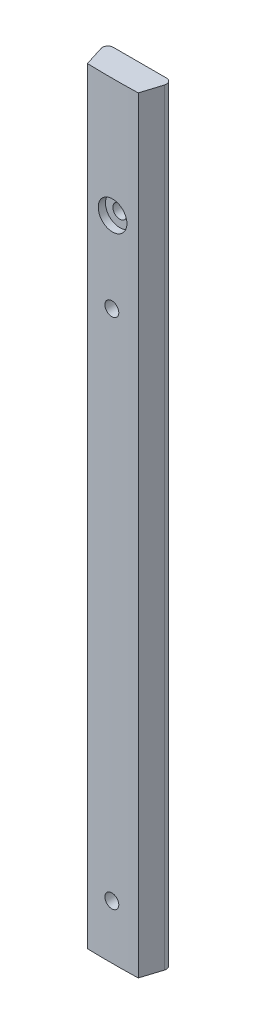
ISO-10303-21;
HEADER;
FILE_DESCRIPTION(('STEP AP214'),'2;1');
FILE_NAME('part.step','',(''),(''),'','','');
FILE_SCHEMA(('AUTOMOTIVE_DESIGN { 1 0 10303 214 1 1 1 1 }'));
ENDSEC;
DATA;
#1=APPLICATION_CONTEXT('core data for automotive mechanical design processes');
#2=APPLICATION_PROTOCOL_DEFINITION('international standard','automotive_design',2000,#1);
#3=PRODUCT_CONTEXT('',#1,'mechanical');
#4=PRODUCT('Part','Part','',(#3));
#5=PRODUCT_RELATED_PRODUCT_CATEGORY('part','',(#4));
#6=PRODUCT_DEFINITION_FORMATION('','',#4);
#7=PRODUCT_DEFINITION_CONTEXT('part definition',#1,'design');
#8=PRODUCT_DEFINITION('design','',#6,#7);
#9=PRODUCT_DEFINITION_SHAPE('','',#8);
#10=(LENGTH_UNIT() NAMED_UNIT(*) SI_UNIT(.MILLI.,.METRE.));
#11=(NAMED_UNIT(*) PLANE_ANGLE_UNIT() SI_UNIT($,.RADIAN.));
#12=(NAMED_UNIT(*) SI_UNIT($,.STERADIAN.) SOLID_ANGLE_UNIT());
#13=UNCERTAINTY_MEASURE_WITH_UNIT(LENGTH_MEASURE(1.E-05),#10,'distance_accuracy_value','');
#14=(GEOMETRIC_REPRESENTATION_CONTEXT(3) GLOBAL_UNCERTAINTY_ASSIGNED_CONTEXT((#13)) GLOBAL_UNIT_ASSIGNED_CONTEXT((#10,
#11,#12)) REPRESENTATION_CONTEXT('',''));
#15=CARTESIAN_POINT('',(0.,0.,0.));
#16=DIRECTION('',(0.,0.,1.));
#17=DIRECTION('',(1.,0.,0.));
#18=AXIS2_PLACEMENT_3D('',#15,#16,#17);
#19=CARTESIAN_POINT('',(1.9939,180.34,6.35));
#20=DIRECTION('',(0.9540716548383,0.,-0.299578499619227));
#21=DIRECTION('',(-0.299578499619227,0.,-0.9540716548383));
#22=AXIS2_PLACEMENT_3D('',#19,#20,#21);
#23=PLANE('',#22);
#24=DIRECTION('',(0.299578499619227,0.,0.9540716548383));
#25=VECTOR('',#24,1.);
#26=CARTESIAN_POINT('',(1.9939,180.34,6.35));
#27=LINE('',#26,#25);
#28=CARTESIAN_POINT('',(0.518245914078155,180.34,1.65046469451642));
#29=VERTEX_POINT('',#28);
#30=CARTESIAN_POINT('',(1.99390000000006,180.34,6.34999999999999));
#31=VERTEX_POINT('',#30);
#32=EDGE_CURVE('E97',#29,#31,#27,.T.);
#33=ORIENTED_EDGE('',*,*,#32,.F.);
#34=DIRECTION('',(0.,-1.,0.));
#35=VECTOR('',#34,1.);
#36=CARTESIAN_POINT('',(0.518245914078155,180.34,1.65046469451642));
#37=LINE('',#36,#35);
#38=CARTESIAN_POINT('',(0.518245914078155,0.,1.65046469451642));
#39=VERTEX_POINT('',#38);
#40=EDGE_CURVE('E181',#29,#39,#37,.T.);
#41=ORIENTED_EDGE('',*,*,#40,.T.);
#42=DIRECTION('',(0.299578499619227,0.,0.9540716548383));
#43=VECTOR('',#42,1.);
#44=CARTESIAN_POINT('',(1.9939,0.,6.35));
#45=LINE('',#44,#43);
#46=CARTESIAN_POINT('',(1.99390000000006,0.,6.34999999999999));
#47=VERTEX_POINT('',#46);
#48=EDGE_CURVE('E119',#39,#47,#45,.T.);
#49=ORIENTED_EDGE('',*,*,#48,.T.);
#50=DIRECTION('',(0.,-1.,0.));
#51=VECTOR('',#50,1.);
#52=CARTESIAN_POINT('',(1.99390000000006,180.34,6.34999999999999));
#53=LINE('',#52,#51);
#54=EDGE_CURVE('E113',#31,#47,#53,.T.);
#55=ORIENTED_EDGE('',*,*,#54,.F.);
#56=EDGE_LOOP('',(#33,#41,#49,#55));
#57=FACE_BOUND('',#56,.T.);
#58=ADVANCED_FACE('F37',(#57),#23,.F.);
#59=CARTESIAN_POINT('',(7.97559999999998,180.34,-196.761937771048));
#60=DIRECTION('',(0.,-1.,0.));
#61=DIRECTION('',(0.,0.,-1.));
#62=AXIS2_PLACEMENT_3D('',#59,#60,#61);
#63=CYLINDRICAL_SURFACE('',#62,203.2);
#64=CARTESIAN_POINT('',(11.34872,152.42446421903,6.41006340398023));
#65=CARTESIAN_POINT('',(11.3487116028228,152.235008593008,6.41006378238871));
#66=CARTESIAN_POINT('',(11.3327049076533,152.045415926008,6.41033124779201));
#67=CARTESIAN_POINT('',(11.2690736851983,151.671453033616,6.41137249531509));
#68=CARTESIAN_POINT('',(11.2214111895212,151.487089357163,6.41214688543111));
#69=CARTESIAN_POINT('',(11.0958264435408,151.129056284475,6.41411423404139));
#70=CARTESIAN_POINT('',(11.017918753737,150.955381788844,6.4153069911008));
#71=CARTESIAN_POINT('',(10.8340754054619,150.623625789682,6.41797641483521));
#72=CARTESIAN_POINT('',(10.7281466773547,150.465540443785,6.41945301128439));
#73=CARTESIAN_POINT('',(10.4912359873182,150.169363130823,6.42252415990603));
#74=CARTESIAN_POINT('',(10.3602492511184,150.031274982623,6.42411873452115));
#75=CARTESIAN_POINT('',(10.0769468888988,149.779043253263,6.42724591237911));
#76=CARTESIAN_POINT('',(9.924630422071,149.664900616467,6.4287785131759));
#77=CARTESIAN_POINT('',(9.60298857960761,149.463802191248,6.43160896080718));
#78=CARTESIAN_POINT('',(9.43366253963362,149.376847465242,6.43290679846705));
#79=CARTESIAN_POINT('',(9.08281308514714,149.232600617332,6.4351213201476));
#80=CARTESIAN_POINT('',(8.90128970262067,149.175308417645,6.43603800516775));
#81=CARTESIAN_POINT('',(8.53121581038614,149.092017775138,6.437386805459));
#82=CARTESIAN_POINT('',(8.34266594537907,149.066016468537,6.43781896507422));
#83=CARTESIAN_POINT('',(7.96387707165026,149.046036916663,6.43815014257954));
#84=CARTESIAN_POINT('',(7.77363806710518,149.05205859223,6.43804916178756));
#85=CARTESIAN_POINT('',(7.39689058699582,149.095951521628,6.43732548273815));
#86=CARTESIAN_POINT('',(7.21038174680259,149.133819646689,6.43670283573209));
#87=CARTESIAN_POINT('',(6.8463689108128,149.240325719582,6.43500607369341));
#88=CARTESIAN_POINT('',(6.66886492768258,149.308963710694,6.43393195802578));
#89=CARTESIAN_POINT('',(6.32789067062203,149.475064693979,6.43145325646011));
#90=CARTESIAN_POINT('',(6.16442109557823,149.572529120581,6.43004865411747));
#91=CARTESIAN_POINT('',(5.85616374442691,149.793515167544,6.42706731850161));
#92=CARTESIAN_POINT('',(5.71137597614947,149.917036798826,6.42549058515623));
#93=CARTESIAN_POINT('',(5.4445739558917,150.186648660855,6.422342505124));
#94=CARTESIAN_POINT('',(5.32256245622761,150.332741615258,6.42077115911064));
#95=CARTESIAN_POINT('',(5.10479766838019,150.643339398926,6.41781120191701));
#96=CARTESIAN_POINT('',(5.00904438385582,150.807844230756,6.41642259076221));
#97=CARTESIAN_POINT('',(4.84651449884216,151.150597482433,6.4139846787907));
#98=CARTESIAN_POINT('',(4.77973798113523,151.328845941541,6.41293537894337));
#99=CARTESIAN_POINT('',(4.67705894666246,151.694025850802,6.41129443788443));
#100=CARTESIAN_POINT('',(4.64115640319315,151.880957293445,6.41070279627699));
#101=CARTESIAN_POINT('',(4.60124783764892,152.258172863403,6.41004394603724));
#102=CARTESIAN_POINT('',(4.5972380081531,152.448456587798,6.40997667480448));
#103=CARTESIAN_POINT('',(4.62121878080885,152.826996165889,6.41037398658509));
#104=CARTESIAN_POINT('',(4.6492093726176,153.015252020241,6.41083856942657));
#105=CARTESIAN_POINT('',(4.73639327436533,153.384381269091,6.4122471560628));
#106=CARTESIAN_POINT('',(4.79558485978915,153.565255071008,6.41319113336076));
#107=CARTESIAN_POINT('',(4.94348872931027,153.914498255294,6.4154520635092));
#108=CARTESIAN_POINT('',(5.03220102895935,154.082867631075,6.41676901655616));
#109=CARTESIAN_POINT('',(5.23663788565666,154.402340036258,6.41962757986307));
#110=CARTESIAN_POINT('',(5.35236500723527,154.55344142437,6.42116921144664));
#111=CARTESIAN_POINT('',(5.60754264534073,154.834072128035,6.42430325480883));
#112=CARTESIAN_POINT('',(5.7469931870476,154.96360142069,6.42589566664135));
#113=CARTESIAN_POINT('',(6.04567540401381,155.197423652298,6.42895192586913));
#114=CARTESIAN_POINT('',(6.20490900446969,155.301714132209,6.43041576072817));
#115=CARTESIAN_POINT('',(6.53862722169922,155.482081385378,6.43304965789855));
#116=CARTESIAN_POINT('',(6.7131118167657,155.558158198792,6.43421972062802));
#117=CARTESIAN_POINT('',(7.07236971588751,155.679934320578,6.43613410516865));
#118=CARTESIAN_POINT('',(7.25714247582176,155.725635233821,6.43687844947182));
#119=CARTESIAN_POINT('',(7.63173956986867,155.785367558489,6.43785757171699));
#120=CARTESIAN_POINT('',(7.82156390894399,155.799398938802,6.43809234915836));
#121=CARTESIAN_POINT('',(8.20085060928758,155.795393612218,6.43802586919465));
#122=CARTESIAN_POINT('',(8.39031301188439,155.77736081667,6.43772467716975));
#123=CARTESIAN_POINT('',(8.76352109145255,155.709746991602,6.43662033689687));
#124=CARTESIAN_POINT('',(8.94726675697265,155.660165898892,6.43581718764349));
#125=CARTESIAN_POINT('',(9.30382896127938,155.53086265055,6.43379944217819));
#126=CARTESIAN_POINT('',(9.47664530009368,155.451139943608,6.43258483844054));
#127=CARTESIAN_POINT('',(9.80643493525647,155.263820222545,6.42988113959192));
#128=CARTESIAN_POINT('',(9.96340883829934,155.156224276408,6.42839205499851));
#129=CARTESIAN_POINT('',(10.2570700478114,154.916209874321,6.42530715057074));
#130=CARTESIAN_POINT('',(10.3937570383994,154.783791031934,6.42371132907499));
#131=CARTESIAN_POINT('',(10.6429953494318,154.497846628208,6.42059244032234));
#132=CARTESIAN_POINT('',(10.7555406695137,154.344315835061,6.41906939122582));
#133=CARTESIAN_POINT('',(10.9533072093302,154.020468838419,6.41626745264257));
#134=CARTESIAN_POINT('',(11.0385139283425,153.850143789454,6.41498869287484));
#135=CARTESIAN_POINT('',(11.1790240680285,153.497736908632,6.41282212586695));
#136=CARTESIAN_POINT('',(11.234363279274,153.31566944219,6.41193385094235));
#137=CARTESIAN_POINT('',(11.2988440082216,153.014448003036,6.41088673750306));
#138=CARTESIAN_POINT('',(11.3175241042297,152.897250671489,6.41057932095988));
#139=CARTESIAN_POINT('',(11.3424647271365,152.661541523736,6.41016753579932));
#140=CARTESIAN_POINT('',(11.3487252551378,152.543029707646,6.4100631671639));
#141=CARTESIAN_POINT('',(11.34872,152.42446421903,6.41006340398023));
#142=B_SPLINE_CURVE_WITH_KNOTS('',3,(#64,#65,#66,#67,#68,#69,#70,#71,#72,#73,#74,#75,#76,#77,
#78,#79,#80,#81,#82,#83,#84,#85,#86,#87,#88,#89,#90,#91,#92,#93,#94,#95,#96,#97,#98,#99,#100,
#101,#102,#103,#104,#105,#106,#107,#108,#109,#110,#111,#112,#113,#114,#115,#116,#117,#118,#119,
#120,#121,#122,#123,#124,#125,#126,#127,#128,#129,#130,#131,#132,#133,#134,#135,#136,#137,#138,
#139,#140,#141),.UNSPECIFIED.,.T.,.F.,(4,2,2,2,2,2,2,2,2,2,2,2,2,2,2,2,2,2,2,2,2,2,2,2,2,2,2,2,
2,2,2,2,2,2,2,2,2,2,4),(0.,0.567934109544087,1.13655064000253,1.70489376853619,2.27309646158712,
2.84140752159343,3.40974099046795,3.97809666523032,4.54645084960929,5.11475301355387,
5.68305377267444,6.25129870534321,6.8195444372903,7.38781845038863,7.95609270166594,
8.52443557960974,9.09277853674933,9.66112311755025,10.2294672067789,10.7977434448474,
11.3660194992437,11.934264147655,12.5025090954231,13.0708080089176,13.6391075256074,
14.2074623899828,14.7758164454163,15.3441404702053,15.9124650533352,16.4807203141805,
17.0489767132285,17.6172435065762,18.1854885295852,18.7537423996301,19.3221373447686,
19.8908332769195,20.458846212673,20.8142718740284,21.1696975038351),.UNSPECIFIED.);
#143=CARTESIAN_POINT('',(11.34872,152.42446421903,6.41006340398023));
#144=VERTEX_POINT('',#143);
#145=EDGE_CURVE('E11',#144,#144,#142,.T.);
#146=ORIENTED_EDGE('',*,*,#145,.T.);
#147=EDGE_LOOP('',(#146));
#148=FACE_BOUND('',#147,.T.);
#149=CARTESIAN_POINT('',(7.97559999999998,131.724817875999,6.43806222895219));
#150=CARTESIAN_POINT('',(7.88431424822669,131.716482364532,6.43806213856655));
#151=CARTESIAN_POINT('',(7.79225808516119,131.715849679626,6.43800005020058));
#152=CARTESIAN_POINT('',(7.60926987110244,131.730049592546,6.4377526810281));
#153=CARTESIAN_POINT('',(7.51833930653425,131.744900806295,6.43756725202921));
#154=CARTESIAN_POINT('',(7.34029856002619,131.789655422659,6.43708858607937));
#155=CARTESIAN_POINT('',(7.25318657257777,131.819551626362,6.4367954007071));
#156=CARTESIAN_POINT('',(7.08524255894046,131.893536649359,6.43612895862586));
#157=CARTESIAN_POINT('',(7.0044089798008,131.937621945046,6.43575572180391));
#158=CARTESIAN_POINT('',(6.85127880177196,132.038741898058,6.43496617625431));
#159=CARTESIAN_POINT('',(6.77898327004224,132.095778171512,6.43454986215467));
#160=CARTESIAN_POINT('',(6.64499109506514,132.221180707891,6.43371665880684));
#161=CARTESIAN_POINT('',(6.5832948690467,132.289547416616,6.43329976953665));
#162=CARTESIAN_POINT('',(6.47225574509907,132.43566876454,6.43250863055911));
#163=CARTESIAN_POINT('',(6.42291287233058,132.513423422858,6.43213438093861));
#164=CARTESIAN_POINT('',(6.33798155361438,132.676113289372,6.43146767728867));
#165=CARTESIAN_POINT('',(6.30239307837522,132.761048482276,6.43117522308503));
#166=CARTESIAN_POINT('',(6.24598130487599,132.935686981974,6.43070289483852));
#167=CARTESIAN_POINT('',(6.22515775361461,133.025390207039,6.43052301886658));
#168=CARTESIAN_POINT('',(6.19886613773452,133.207019421458,6.43029483768381));
#169=CARTESIAN_POINT('',(6.19339804205127,133.298945406316,6.4302465322068));
#170=CARTESIAN_POINT('',(6.19797244345632,133.482407654437,6.43028660032644));
#171=CARTESIAN_POINT('',(6.20801444367391,133.573943930092,6.43037496954468));
#172=CARTESIAN_POINT('',(6.2433230016243,133.75403137867,6.43067903436351));
#173=CARTESIAN_POINT('',(6.26858957557231,133.842582548415,6.43089473009973));
#174=CARTESIAN_POINT('',(6.3336299858266,134.01418621545,6.43143068696838));
#175=CARTESIAN_POINT('',(6.37340384370074,134.097238704566,6.43175094825628));
#176=CARTESIAN_POINT('',(6.4663296918883,134.255487501418,6.43246238092685));
#177=CARTESIAN_POINT('',(6.5194816797676,134.330683810584,6.43285355229662));
#178=CARTESIAN_POINT('',(6.63765706614934,134.471088376568,6.43366599597863));
#179=CARTESIAN_POINT('',(6.70268086206281,134.536296298888,6.43408726929825));
#180=CARTESIAN_POINT('',(6.84275300904769,134.654870193758,6.43491641920782));
#181=CARTESIAN_POINT('',(6.91780136248668,134.70823616351,6.43532429579461));
#182=CARTESIAN_POINT('',(7.07579369241682,134.801612035962,6.43608530070316));
#183=CARTESIAN_POINT('',(7.15873779472453,134.841621725788,6.43643842815228));
#184=CARTESIAN_POINT('',(7.33016613017262,134.907147973031,6.43705522668769));
#185=CARTESIAN_POINT('',(7.41865036220599,134.932664533343,6.43731889779184));
#186=CARTESIAN_POINT('',(7.59864500225191,134.968479601402,6.43773250521641));
#187=CARTESIAN_POINT('',(7.69015534051967,134.978778459632,6.43788244415619));
#188=CARTESIAN_POINT('',(7.87360631236106,134.983866770805,6.43805733300644));
#189=CARTESIAN_POINT('',(7.96554694588195,134.978656225649,6.43808228293223));
#190=CARTESIAN_POINT('',(8.14724610260202,134.952873970405,6.43801004860094));
#191=CARTESIAN_POINT('',(8.23700468152284,134.932302653002,6.43791286746599));
#192=CARTESIAN_POINT('',(8.41179422673059,134.876383328365,6.43761286431377));
#193=CARTESIAN_POINT('',(8.4968251933199,134.841035322077,6.43741004230325));
#194=CARTESIAN_POINT('',(8.6597466393987,134.756565708795,6.4369268609132));
#195=CARTESIAN_POINT('',(8.73763705461159,134.707443977832,6.43664650083579));
#196=CARTESIAN_POINT('',(8.88406571782481,134.596821412233,6.43604465084853));
#197=CARTESIAN_POINT('',(8.95260396039356,134.535320570407,6.43572316091479));
#198=CARTESIAN_POINT('',(9.07838454379061,134.401683677518,6.43507950990417));
#199=CARTESIAN_POINT('',(9.13562658287217,134.329547342445,6.43475734880959));
#200=CARTESIAN_POINT('',(9.23718753441021,134.176688378562,6.43415221369749));
#201=CARTESIAN_POINT('',(9.28150646046484,134.095965758786,6.43386923963873));
#202=CARTESIAN_POINT('',(9.355963184878,133.928225431026,6.43337711365413));
#203=CARTESIAN_POINT('',(9.38610096541735,133.841207715132,6.43316796182105));
#204=CARTESIAN_POINT('',(9.43133971337324,133.66334732634,6.43284892007526));
#205=CARTESIAN_POINT('',(9.446440656141,133.572504647172,6.43273903032525));
#206=CARTESIAN_POINT('',(9.46117669879655,133.389575692135,6.43263183602347));
#207=CARTESIAN_POINT('',(9.46081219030212,133.297489447815,6.43263452862087));
#208=CARTESIAN_POINT('',(9.4446286211387,133.114685032301,6.43275216592183));
#209=CARTESIAN_POINT('',(9.42880953030005,133.023966863778,6.43286711084453));
#210=CARTESIAN_POINT('',(9.38216571242669,132.846473166401,6.43319531989032));
#211=CARTESIAN_POINT('',(9.35134083894985,132.759697676033,6.43340858497293));
#212=CARTESIAN_POINT('',(9.27556176624201,132.592556757529,6.4339074797193));
#213=CARTESIAN_POINT('',(9.23060811930015,132.512191078988,6.43419310655437));
#214=CARTESIAN_POINT('',(9.12785234444079,132.360153613818,6.43480173303033));
#215=CARTESIAN_POINT('',(9.0700512981975,132.28848109606,6.43512472952382));
#216=CARTESIAN_POINT('',(8.943219902479,132.155838814001,6.43576822615359));
#217=CARTESIAN_POINT('',(8.87418676601513,132.094871713832,6.43608872564956));
#218=CARTESIAN_POINT('',(8.72683663253741,131.985368429439,6.43668690294309));
#219=CARTESIAN_POINT('',(8.64851507586061,131.936838387794,6.436964559554));
#220=CARTESIAN_POINT('',(8.48489589391178,131.853669356951,6.43744037859891));
#221=CARTESIAN_POINT('',(8.39960677017553,131.819013734783,6.43763863621833));
#222=CARTESIAN_POINT('',(8.25736744198429,131.774739108791,6.43787427988784));
#223=CARTESIAN_POINT('',(8.20178018154065,131.760604719937,6.43794411151631));
#224=CARTESIAN_POINT('',(8.08942896818944,131.738249472323,6.43803811429938));
#225=CARTESIAN_POINT('',(8.03266501529589,131.730028613492,6.43806228545452));
#226=CARTESIAN_POINT('',(7.97559999999998,131.724817875999,6.43806222895219));
#227=B_SPLINE_CURVE_WITH_KNOTS('',3,(#149,#150,#151,#152,#153,#154,#155,#156,#157,#158,#159,
#160,#161,#162,#163,#164,#165,#166,#167,#168,#169,#170,#171,#172,#173,#174,#175,#176,#177,#178,
#179,#180,#181,#182,#183,#184,#185,#186,#187,#188,#189,#190,#191,#192,#193,#194,#195,#196,#197,
#198,#199,#200,#201,#202,#203,#204,#205,#206,#207,#208,#209,#210,#211,#212,#213,#214,#215,#216,
#217,#218,#219,#220,#221,#222,#223,#224,#225,#226),.UNSPECIFIED.,.T.,.F.,(4,2,2,2,2,2,2,2,2,2,2,
2,2,2,2,2,2,2,2,2,2,2,2,2,2,2,2,2,2,2,2,2,2,2,2,2,2,2,4),(0.,0.274787433795373,
0.549905619375806,0.824892288012678,1.09981072123875,1.37476347987757,1.6497270592225,
1.92469119859528,2.19965475239981,2.47461359450935,2.74957188036875,3.02452135803742,
3.29947112854664,3.57442130782287,3.84937143707221,4.12433077201746,4.39929017190188,
4.67425395392105,4.94921768099808,5.22417507520374,5.49913243569715,5.77408276740186,
6.04903308152043,6.32398587039712,6.59893881896119,6.87389911113674,7.14885911398853,
7.42381946233776,7.69878026140848,7.97373409789694,8.24868847113767,8.52364552772473,
8.79859183766677,9.07351500753652,9.34850649768334,9.62363354365946,9.89842976626594,
10.0702062921185,10.2419828159247),.UNSPECIFIED.);
#228=CARTESIAN_POINT('',(7.97559999999998,131.724817875999,6.43806222895219));
#229=VERTEX_POINT('',#228);
#230=EDGE_CURVE('E124',#229,#229,#227,.T.);
#231=ORIENTED_EDGE('',*,*,#230,.T.);
#232=EDGE_LOOP('',(#231));
#233=FACE_BOUND('',#232,.T.);
#234=CARTESIAN_POINT('',(7.97559999999998,11.0748178759992,6.43806222895219));
#235=CARTESIAN_POINT('',(7.88431424822669,11.0664823645321,6.43806213856655));
#236=CARTESIAN_POINT('',(7.79225808516119,11.0658496796257,6.43800005020058));
#237=CARTESIAN_POINT('',(7.60926987110244,11.0800495925458,6.4377526810281));
#238=CARTESIAN_POINT('',(7.51833930653425,11.0949008062954,6.43756725202921));
#239=CARTESIAN_POINT('',(7.34029856002619,11.1396554226593,6.43708858607937));
#240=CARTESIAN_POINT('',(7.25318657257778,11.1695516263617,6.4367954007071));
#241=CARTESIAN_POINT('',(7.08524255894046,11.2435366493587,6.43612895862586));
#242=CARTESIAN_POINT('',(7.0044089798008,11.2876219450455,6.43575572180391));
#243=CARTESIAN_POINT('',(6.85127880177196,11.3887418980584,6.43496617625432));
#244=CARTESIAN_POINT('',(6.77898327004223,11.4457781715121,6.43454986215468));
#245=CARTESIAN_POINT('',(6.64499109506514,11.5711807078906,6.43371665880684));
#246=CARTESIAN_POINT('',(6.5832948690467,11.6395474166165,6.43329976953665));
#247=CARTESIAN_POINT('',(6.47225574509907,11.7856687645397,6.43250863055911));
#248=CARTESIAN_POINT('',(6.42291287233059,11.8634234228575,6.43213438093861));
#249=CARTESIAN_POINT('',(6.33798155361438,12.0261132893716,6.43146767728867));
#250=CARTESIAN_POINT('',(6.30239307837523,12.1110484822756,6.43117522308504));
#251=CARTESIAN_POINT('',(6.245981304876,12.2856869819744,6.43070289483852));
#252=CARTESIAN_POINT('',(6.22515775361462,12.3753902070392,6.43052301886658));
#253=CARTESIAN_POINT('',(6.19886613773452,12.5570194214583,6.43029483768381));
#254=CARTESIAN_POINT('',(6.19339804205127,12.6489454063157,6.4302465322068));
#255=CARTESIAN_POINT('',(6.19797244345632,12.8324076544373,6.43028660032644));
#256=CARTESIAN_POINT('',(6.20801444367391,12.9239439300918,6.43037496954467));
#257=CARTESIAN_POINT('',(6.2433230016243,13.1040313786702,6.43067903436351));
#258=CARTESIAN_POINT('',(6.26858957557231,13.1925825484145,6.43089473009973));
#259=CARTESIAN_POINT('',(6.3336299858266,13.3641862154501,6.43143068696839));
#260=CARTESIAN_POINT('',(6.37340384370073,13.4472387045662,6.43175094825629));
#261=CARTESIAN_POINT('',(6.4663296918883,13.6054875014184,6.43246238092685));
#262=CARTESIAN_POINT('',(6.51948167976759,13.6806838105839,6.43285355229662));
#263=CARTESIAN_POINT('',(6.63765706614933,13.8210883765676,6.43366599597863));
#264=CARTESIAN_POINT('',(6.7026808620628,13.8862962988882,6.43408726929825));
#265=CARTESIAN_POINT('',(6.84275300904769,14.0048701937576,6.43491641920782));
#266=CARTESIAN_POINT('',(6.91780136248668,14.0582361635096,6.43532429579461));
#267=CARTESIAN_POINT('',(7.07579369241683,14.1516120359622,6.43608530070316));
#268=CARTESIAN_POINT('',(7.15873779472453,14.1916217257884,6.43643842815228));
#269=CARTESIAN_POINT('',(7.33016613017262,14.2571479730308,6.43705522668769));
#270=CARTESIAN_POINT('',(7.41865036220599,14.2826645333428,6.43731889779185));
#271=CARTESIAN_POINT('',(7.59864500225191,14.3184796014016,6.43773250521641));
#272=CARTESIAN_POINT('',(7.69015534051966,14.328778459632,6.43788244415617));
#273=CARTESIAN_POINT('',(7.87360631236106,14.3338667708046,6.43805733300641));
#274=CARTESIAN_POINT('',(7.96554694588194,14.3286562256485,6.43808228293222));
#275=CARTESIAN_POINT('',(8.14724610260202,14.3028739704052,6.43801004860095));
#276=CARTESIAN_POINT('',(8.23700468152284,14.282302653002,6.437912867466));
#277=CARTESIAN_POINT('',(8.41179422673058,14.2263833283651,6.43761286431377));
#278=CARTESIAN_POINT('',(8.49682519331989,14.1910353220765,6.43741004230325));
#279=CARTESIAN_POINT('',(8.6597466393987,14.1065657087947,6.4369268609132));
#280=CARTESIAN_POINT('',(8.7376370546116,14.0574439778315,6.43664650083579));
#281=CARTESIAN_POINT('',(8.88406571782483,13.9468214122327,6.43604465084853));
#282=CARTESIAN_POINT('',(8.95260396039357,13.8853205704074,6.43572316091479));
#283=CARTESIAN_POINT('',(9.07838454379062,13.7516836775177,6.43507950990417));
#284=CARTESIAN_POINT('',(9.13562658287218,13.6795473424453,6.43475734880959));
#285=CARTESIAN_POINT('',(9.23718753441022,13.526688378562,6.43415221369749));
#286=CARTESIAN_POINT('',(9.28150646046484,13.4459657587858,6.43386923963873));
#287=CARTESIAN_POINT('',(9.355963184878,13.2782254310255,6.43337711365413));
#288=CARTESIAN_POINT('',(9.38610096541735,13.1912077151315,6.43316796182105));
#289=CARTESIAN_POINT('',(9.43133971337324,13.0133473263395,6.43284892007526));
#290=CARTESIAN_POINT('',(9.446440656141,12.9225046471718,6.43273903032525));
#291=CARTESIAN_POINT('',(9.46117669879655,12.7395756921352,6.43263183602347));
#292=CARTESIAN_POINT('',(9.46081219030212,12.6474894478151,6.43263452862087));
#293=CARTESIAN_POINT('',(9.4446286211387,12.4646850323008,6.43275216592183));
#294=CARTESIAN_POINT('',(9.42880953030005,12.3739668637777,6.43286711084453));
#295=CARTESIAN_POINT('',(9.3821657124267,12.1964731664009,6.43319531989032));
#296=CARTESIAN_POINT('',(9.35134083894986,12.1096976760331,6.43340858497293));
#297=CARTESIAN_POINT('',(9.27556176624201,11.9425567575285,6.4339074797193));
#298=CARTESIAN_POINT('',(9.23060811930014,11.8621910789882,6.43419310655437));
#299=CARTESIAN_POINT('',(9.12785234444079,11.7101536138177,6.43480173303033));
#300=CARTESIAN_POINT('',(9.07005129819749,11.6384810960602,6.43512472952382));
#301=CARTESIAN_POINT('',(8.943219902479,11.5058388140007,6.43576822615359));
#302=CARTESIAN_POINT('',(8.87418676601514,11.4448717138319,6.43608872564956));
#303=CARTESIAN_POINT('',(8.72683663253743,11.3353684294389,6.43668690294309));
#304=CARTESIAN_POINT('',(8.64851507586062,11.2868383877938,6.436964559554));
#305=CARTESIAN_POINT('',(8.48489589391178,11.2036693569508,6.43744037859891));
#306=CARTESIAN_POINT('',(8.39960677017553,11.1690137347831,6.43763863621833));
#307=CARTESIAN_POINT('',(8.25736744198429,11.1247391087907,6.43787427988784));
#308=CARTESIAN_POINT('',(8.20178018154064,11.1106047199373,6.43794411151631));
#309=CARTESIAN_POINT('',(8.08942896818943,11.0882494723234,6.43803811429938));
#310=CARTESIAN_POINT('',(8.03266501529589,11.0800286134925,6.43806228545452));
#311=CARTESIAN_POINT('',(7.97559999999998,11.0748178759992,6.43806222895219));
#312=B_SPLINE_CURVE_WITH_KNOTS('',3,(#234,#235,#236,#237,#238,#239,#240,#241,#242,#243,#244,
#245,#246,#247,#248,#249,#250,#251,#252,#253,#254,#255,#256,#257,#258,#259,#260,#261,#262,#263,
#264,#265,#266,#267,#268,#269,#270,#271,#272,#273,#274,#275,#276,#277,#278,#279,#280,#281,#282,
#283,#284,#285,#286,#287,#288,#289,#290,#291,#292,#293,#294,#295,#296,#297,#298,#299,#300,#301,
#302,#303,#304,#305,#306,#307,#308,#309,#310,#311),.UNSPECIFIED.,.T.,.F.,(4,2,2,2,2,2,2,2,2,2,2,
2,2,2,2,2,2,2,2,2,2,2,2,2,2,2,2,2,2,2,2,2,2,2,2,2,2,2,4),(0.,0.274787433795373,
0.549905619375801,0.824892288012675,1.09981072123875,1.37476347987758,1.6497270592225,
1.92469119859527,2.19965475239979,2.47461359450933,2.74957188036875,3.02452135803741,
3.29947112854663,3.57442130782285,3.84937143707219,4.12433077201746,4.3992901719019,
4.67425395392106,4.94921768099808,5.22417507520374,5.49913243569715,5.77408276740187,
6.04903308152043,6.32398587039714,6.59893881896121,6.87389911113677,7.14885911398854,
7.42381946233776,7.69878026140846,7.97373409789692,8.24868847113765,8.52364552772474,
8.7985918376668,9.07351500753653,9.34850649768333,9.62363354365947,9.89842976626595,
10.0702062921185,10.2419828159247),.UNSPECIFIED.);
#313=CARTESIAN_POINT('',(7.97559999999998,11.0748178759992,6.43806222895219));
#314=VERTEX_POINT('',#313);
#315=EDGE_CURVE('E121',#314,#314,#312,.T.);
#316=ORIENTED_EDGE('',*,*,#315,.T.);
#317=EDGE_LOOP('',(#316));
#318=FACE_BOUND('',#317,.T.);
#319=CARTESIAN_POINT('',(7.97559999999998,0.,-196.761937771048));
#320=DIRECTION('',(0.,1.,0.));
#321=DIRECTION('',(0.,0.,-1.));
#322=AXIS2_PLACEMENT_3D('',#319,#320,#321);
#323=CIRCLE('',#322,203.2);
#324=CARTESIAN_POINT('',(13.9573,0.,6.35));
#325=VERTEX_POINT('',#324);
#326=EDGE_CURVE('E258',#47,#325,#323,.T.);
#327=ORIENTED_EDGE('',*,*,#326,.T.);
#328=DIRECTION('',(0.,-1.,0.));
#329=VECTOR('',#328,1.);
#330=CARTESIAN_POINT('',(13.9573,180.34,6.35));
#331=LINE('',#330,#329);
#332=CARTESIAN_POINT('',(13.9573,180.34,6.35));
#333=VERTEX_POINT('',#332);
#334=EDGE_CURVE('E115',#333,#325,#331,.T.);
#335=ORIENTED_EDGE('',*,*,#334,.F.);
#336=CARTESIAN_POINT('',(7.97559999999998,180.34,-196.761937771048));
#337=DIRECTION('',(0.,1.,0.));
#338=DIRECTION('',(0.,0.,-1.));
#339=AXIS2_PLACEMENT_3D('',#336,#337,#338);
#340=CIRCLE('',#339,203.2);
#341=EDGE_CURVE('E100',#31,#333,#340,.T.);
#342=ORIENTED_EDGE('',*,*,#341,.F.);
#343=ORIENTED_EDGE('',*,*,#54,.T.);
#344=EDGE_LOOP('',(#327,#335,#342,#343));
#345=FACE_BOUND('',#344,.T.);
#346=ADVANCED_FACE('F112',(#148,#233,#318,#345),#63,.T.);
#347=CARTESIAN_POINT('',(15.9512,180.34,0.));
#348=DIRECTION('',(-0.9540716548383,0.,-0.299578499619226));
#349=DIRECTION('',(-0.299578499619226,0.,0.9540716548383));
#350=AXIS2_PLACEMENT_3D('',#347,#348,#349);
#351=PLANE('',#350);
#352=DIRECTION('',(0.299578499619226,0.,-0.954071654838301));
#353=VECTOR('',#352,1.);
#354=CARTESIAN_POINT('',(15.9512,0.,0.));
#355=LINE('',#354,#353);
#356=CARTESIAN_POINT('',(15.4329540859218,0.,1.65046469451642));
#357=VERTEX_POINT('',#356);
#358=EDGE_CURVE('E260',#325,#357,#355,.T.);
#359=ORIENTED_EDGE('',*,*,#358,.T.);
#360=DIRECTION('',(0.,-1.,0.));
#361=VECTOR('',#360,1.);
#362=CARTESIAN_POINT('',(15.4329540859218,180.34,1.65046469451642));
#363=LINE('',#362,#361);
#364=CARTESIAN_POINT('',(15.4329540859218,180.34,1.65046469451642));
#365=VERTEX_POINT('',#364);
#366=EDGE_CURVE('E50',#357,#365,#363,.F.);
#367=ORIENTED_EDGE('',*,*,#366,.T.);
#368=DIRECTION('',(0.299578499619226,0.,-0.954071654838301));
#369=VECTOR('',#368,1.);
#370=CARTESIAN_POINT('',(15.9512,180.34,0.));
#371=LINE('',#370,#369);
#372=EDGE_CURVE('E116',#333,#365,#371,.T.);
#373=ORIENTED_EDGE('',*,*,#372,.F.);
#374=ORIENTED_EDGE('',*,*,#334,.T.);
#375=EDGE_LOOP('',(#359,#367,#373,#374));
#376=FACE_BOUND('',#375,.T.);
#377=ADVANCED_FACE('F158',(#376),#351,.F.);
#378=CARTESIAN_POINT('',(0.,180.34,0.));
#379=DIRECTION('',(0.,0.,1.));
#380=DIRECTION('',(1.,0.,0.));
#381=AXIS2_PLACEMENT_3D('',#378,#379,#380);
#382=PLANE('',#381);
#383=CARTESIAN_POINT('',(7.97560000000003,152.42446421903,0.));
#384=DIRECTION('',(0.,0.,1.));
#385=DIRECTION('',(1.,0.,0.));
#386=AXIS2_PLACEMENT_3D('',#383,#384,#385);
#387=CIRCLE('',#386,1.63195);
#388=CARTESIAN_POINT('',(9.60755000000003,152.42446421903,0.));
#389=VERTEX_POINT('',#388);
#390=EDGE_CURVE('E233',#389,#389,#387,.T.);
#391=ORIENTED_EDGE('',*,*,#390,.T.);
#392=EDGE_LOOP('',(#391));
#393=FACE_BOUND('',#392,.T.);
#394=CARTESIAN_POINT('',(7.82712823053444,133.35,0.));
#395=DIRECTION('',(0.,0.,-1.));
#396=DIRECTION('',(-1.,0.,0.));
#397=AXIS2_PLACEMENT_3D('',#394,#395,#396);
#398=CIRCLE('',#397,3.37312);
#399=CARTESIAN_POINT('',(4.45400823053444,133.35,0.));
#400=VERTEX_POINT('',#399);
#401=EDGE_CURVE('E238',#400,#400,#398,.T.);
#402=ORIENTED_EDGE('',*,*,#401,.F.);
#403=EDGE_LOOP('',(#402));
#404=FACE_BOUND('',#403,.T.);
#405=CARTESIAN_POINT('',(7.82712823053444,12.7,0.));
#406=DIRECTION('',(0.,0.,-1.));
#407=DIRECTION('',(-1.,0.,0.));
#408=AXIS2_PLACEMENT_3D('',#405,#406,#407);
#409=CIRCLE('',#408,3.37312);
#410=CARTESIAN_POINT('',(4.45400823053444,12.7,0.));
#411=VERTEX_POINT('',#410);
#412=EDGE_CURVE('E246',#411,#411,#409,.T.);
#413=ORIENTED_EDGE('',*,*,#412,.F.);
#414=EDGE_LOOP('',(#413));
#415=FACE_BOUND('',#414,.T.);
#416=DIRECTION('',(-1.,0.,0.));
#417=VECTOR('',#416,1.);
#418=CARTESIAN_POINT('',(0.,0.,0.));
#419=LINE('',#418,#417);
#420=CARTESIAN_POINT('',(14.2212830842772,0.,0.));
#421=VERTEX_POINT('',#420);
#422=CARTESIAN_POINT('',(1.7299169157228,0.,0.));
#423=VERTEX_POINT('',#422);
#424=EDGE_CURVE('E108',#421,#423,#419,.T.);
#425=ORIENTED_EDGE('',*,*,#424,.T.);
#426=DIRECTION('',(0.,-1.,0.));
#427=VECTOR('',#426,1.);
#428=CARTESIAN_POINT('',(1.7299169157228,180.34,0.));
#429=LINE('',#428,#427);
#430=CARTESIAN_POINT('',(1.7299169157228,180.34,0.));
#431=VERTEX_POINT('',#430);
#432=EDGE_CURVE('E64',#423,#431,#429,.F.);
#433=ORIENTED_EDGE('',*,*,#432,.T.);
#434=DIRECTION('',(-1.,0.,0.));
#435=VECTOR('',#434,1.);
#436=CARTESIAN_POINT('',(0.,180.34,0.));
#437=LINE('',#436,#435);
#438=CARTESIAN_POINT('',(14.2212830842772,180.34,0.));
#439=VERTEX_POINT('',#438);
#440=EDGE_CURVE('E126',#439,#431,#437,.T.);
#441=ORIENTED_EDGE('',*,*,#440,.F.);
#442=DIRECTION('',(0.,-1.,0.));
#443=VECTOR('',#442,1.);
#444=CARTESIAN_POINT('',(14.2212830842772,180.34,0.));
#445=LINE('',#444,#443);
#446=EDGE_CURVE('E187',#439,#421,#445,.T.);
#447=ORIENTED_EDGE('',*,*,#446,.T.);
#448=EDGE_LOOP('',(#425,#433,#441,#447));
#449=FACE_BOUND('',#448,.T.);
#450=ADVANCED_FACE('F153',(#393,#404,#415,#449),#382,.F.);
#451=CARTESIAN_POINT('',(7.97559999999998,180.34,-196.761937771048));
#452=DIRECTION('',(0.,-1.,0.));
#453=DIRECTION('',(0.,0.,-1.));
#454=AXIS2_PLACEMENT_3D('',#451,#452,#453);
#455=PLANE('',#454);
#456=ORIENTED_EDGE('',*,*,#440,.T.);
#457=CARTESIAN_POINT('',(1.7299169157228,180.34,1.27));
#458=DIRECTION('',(0.,-1.,0.));
#459=DIRECTION('',(0.,0.,-1.));
#460=AXIS2_PLACEMENT_3D('',#457,#458,#459);
#461=CIRCLE('',#460,1.27);
#462=EDGE_CURVE('E103',#431,#29,#461,.F.);
#463=ORIENTED_EDGE('',*,*,#462,.T.);
#464=ORIENTED_EDGE('',*,*,#32,.T.);
#465=ORIENTED_EDGE('',*,*,#341,.T.);
#466=ORIENTED_EDGE('',*,*,#372,.T.);
#467=CARTESIAN_POINT('',(14.2212830842772,180.34,1.27));
#468=DIRECTION('',(0.,-1.,0.));
#469=DIRECTION('',(0.,0.,-1.));
#470=AXIS2_PLACEMENT_3D('',#467,#468,#469);
#471=CIRCLE('',#470,1.27);
#472=EDGE_CURVE('E182',#365,#439,#471,.F.);
#473=ORIENTED_EDGE('',*,*,#472,.T.);
#474=EDGE_LOOP('',(#456,#463,#464,#465,#466,#473));
#475=FACE_BOUND('',#474,.T.);
#476=ADVANCED_FACE('F99',(#475),#455,.F.);
#477=CARTESIAN_POINT('',(7.97559999999998,0.,-196.761937771048));
#478=DIRECTION('',(0.,-1.,0.));
#479=DIRECTION('',(0.,0.,-1.));
#480=AXIS2_PLACEMENT_3D('',#477,#478,#479);
#481=PLANE('',#480);
#482=ORIENTED_EDGE('',*,*,#48,.F.);
#483=CARTESIAN_POINT('',(1.7299169157228,0.,1.27));
#484=DIRECTION('',(0.,-1.,0.));
#485=DIRECTION('',(0.,0.,-1.));
#486=AXIS2_PLACEMENT_3D('',#483,#484,#485);
#487=CIRCLE('',#486,1.27);
#488=EDGE_CURVE('E190',#39,#423,#487,.T.);
#489=ORIENTED_EDGE('',*,*,#488,.T.);
#490=ORIENTED_EDGE('',*,*,#424,.F.);
#491=CARTESIAN_POINT('',(14.2212830842772,0.,1.27));
#492=DIRECTION('',(0.,-1.,0.));
#493=DIRECTION('',(0.,0.,-1.));
#494=AXIS2_PLACEMENT_3D('',#491,#492,#493);
#495=CIRCLE('',#494,1.27);
#496=EDGE_CURVE('E192',#421,#357,#495,.T.);
#497=ORIENTED_EDGE('',*,*,#496,.T.);
#498=ORIENTED_EDGE('',*,*,#358,.F.);
#499=ORIENTED_EDGE('',*,*,#326,.F.);
#500=EDGE_LOOP('',(#482,#489,#490,#497,#498,#499));
#501=FACE_BOUND('',#500,.T.);
#502=ADVANCED_FACE('F148',(#501),#481,.T.);
#503=CARTESIAN_POINT('',(7.82712823053444,12.7,0.));
#504=DIRECTION('',(0.,0.,-1.));
#505=DIRECTION('',(-1.,0.,0.));
#506=AXIS2_PLACEMENT_3D('',#503,#504,#505);
#507=CYLINDRICAL_SURFACE('',#506,1.63195);
#508=CARTESIAN_POINT('',(7.82712823053444,12.7,1.7272));
#509=DIRECTION('',(0.,0.,-1.));
#510=DIRECTION('',(-1.,0.,0.));
#511=AXIS2_PLACEMENT_3D('',#508,#509,#510);
#512=CIRCLE('',#511,1.63195);
#513=CARTESIAN_POINT('',(6.19517823053444,12.7,1.7272));
#514=VERTEX_POINT('',#513);
#515=EDGE_CURVE('E252',#514,#514,#512,.T.);
#516=ORIENTED_EDGE('',*,*,#515,.T.);
#517=EDGE_LOOP('',(#516));
#518=FACE_BOUND('',#517,.T.);
#519=ORIENTED_EDGE('',*,*,#315,.F.);
#520=EDGE_LOOP('',(#519));
#521=FACE_BOUND('',#520,.T.);
#522=ADVANCED_FACE('F142',(#518,#521),#507,.F.);
#523=CARTESIAN_POINT('',(9.45907823053444,12.7,1.7272));
#524=DIRECTION('',(0.,0.,1.));
#525=DIRECTION('',(1.,0.,0.));
#526=AXIS2_PLACEMENT_3D('',#523,#524,#525);
#527=PLANE('',#526);
#528=ORIENTED_EDGE('',*,*,#515,.F.);
#529=EDGE_LOOP('',(#528));
#530=FACE_BOUND('',#529,.T.);
#531=CARTESIAN_POINT('',(7.82712823053444,12.7,1.7272));
#532=DIRECTION('',(0.,0.,-1.));
#533=DIRECTION('',(-1.,0.,0.));
#534=AXIS2_PLACEMENT_3D('',#531,#532,#533);
#535=CIRCLE('',#534,3.37312);
#536=CARTESIAN_POINT('',(4.45400823053444,12.7,1.7272));
#537=VERTEX_POINT('',#536);
#538=EDGE_CURVE('E249',#537,#537,#535,.T.);
#539=ORIENTED_EDGE('',*,*,#538,.T.);
#540=EDGE_LOOP('',(#539));
#541=FACE_BOUND('',#540,.T.);
#542=ADVANCED_FACE('F147',(#530,#541),#527,.F.);
#543=CARTESIAN_POINT('',(7.82712823053444,12.7,0.));
#544=DIRECTION('',(0.,0.,-1.));
#545=DIRECTION('',(-1.,0.,0.));
#546=AXIS2_PLACEMENT_3D('',#543,#544,#545);
#547=CYLINDRICAL_SURFACE('',#546,3.37312);
#548=ORIENTED_EDGE('',*,*,#538,.F.);
#549=EDGE_LOOP('',(#548));
#550=FACE_BOUND('',#549,.T.);
#551=ORIENTED_EDGE('',*,*,#412,.T.);
#552=EDGE_LOOP('',(#551));
#553=FACE_BOUND('',#552,.T.);
#554=ADVANCED_FACE('F200',(#550,#553),#547,.F.);
#555=CARTESIAN_POINT('',(7.82712823053444,133.35,0.));
#556=DIRECTION('',(0.,0.,-1.));
#557=DIRECTION('',(-1.,0.,0.));
#558=AXIS2_PLACEMENT_3D('',#555,#556,#557);
#559=CYLINDRICAL_SURFACE('',#558,1.63195);
#560=CARTESIAN_POINT('',(7.82712823053444,133.35,1.7272));
#561=DIRECTION('',(0.,0.,-1.));
#562=DIRECTION('',(-1.,0.,0.));
#563=AXIS2_PLACEMENT_3D('',#560,#561,#562);
#564=CIRCLE('',#563,1.63195);
#565=CARTESIAN_POINT('',(6.19517823053444,133.35,1.7272));
#566=VERTEX_POINT('',#565);
#567=EDGE_CURVE('E244',#566,#566,#564,.T.);
#568=ORIENTED_EDGE('',*,*,#567,.T.);
#569=EDGE_LOOP('',(#568));
#570=FACE_BOUND('',#569,.T.);
#571=ORIENTED_EDGE('',*,*,#230,.F.);
#572=EDGE_LOOP('',(#571));
#573=FACE_BOUND('',#572,.T.);
#574=ADVANCED_FACE('F198',(#570,#573),#559,.F.);
#575=CARTESIAN_POINT('',(9.45907823053444,133.35,1.7272));
#576=DIRECTION('',(0.,0.,1.));
#577=DIRECTION('',(1.,0.,0.));
#578=AXIS2_PLACEMENT_3D('',#575,#576,#577);
#579=PLANE('',#578);
#580=ORIENTED_EDGE('',*,*,#567,.F.);
#581=EDGE_LOOP('',(#580));
#582=FACE_BOUND('',#581,.T.);
#583=CARTESIAN_POINT('',(7.82712823053444,133.35,1.7272));
#584=DIRECTION('',(0.,0.,-1.));
#585=DIRECTION('',(-1.,0.,0.));
#586=AXIS2_PLACEMENT_3D('',#583,#584,#585);
#587=CIRCLE('',#586,3.37312);
#588=CARTESIAN_POINT('',(4.45400823053444,133.35,1.7272));
#589=VERTEX_POINT('',#588);
#590=EDGE_CURVE('E241',#589,#589,#587,.T.);
#591=ORIENTED_EDGE('',*,*,#590,.T.);
#592=EDGE_LOOP('',(#591));
#593=FACE_BOUND('',#592,.T.);
#594=ADVANCED_FACE('F178',(#582,#593),#579,.F.);
#595=CARTESIAN_POINT('',(7.82712823053444,133.35,0.));
#596=DIRECTION('',(0.,0.,-1.));
#597=DIRECTION('',(-1.,0.,0.));
#598=AXIS2_PLACEMENT_3D('',#595,#596,#597);
#599=CYLINDRICAL_SURFACE('',#598,3.37312);
#600=ORIENTED_EDGE('',*,*,#590,.F.);
#601=EDGE_LOOP('',(#600));
#602=FACE_BOUND('',#601,.T.);
#603=ORIENTED_EDGE('',*,*,#401,.T.);
#604=EDGE_LOOP('',(#603));
#605=FACE_BOUND('',#604,.T.);
#606=ADVANCED_FACE('F170',(#602,#605),#599,.F.);
#607=CARTESIAN_POINT('',(1.7299169157228,180.34,1.27));
#608=DIRECTION('',(0.,-1.,0.));
#609=DIRECTION('',(0.,0.,-1.));
#610=AXIS2_PLACEMENT_3D('',#607,#608,#609);
#611=CYLINDRICAL_SURFACE('',#610,1.27);
#612=ORIENTED_EDGE('',*,*,#462,.F.);
#613=ORIENTED_EDGE('',*,*,#432,.F.);
#614=ORIENTED_EDGE('',*,*,#488,.F.);
#615=ORIENTED_EDGE('',*,*,#40,.F.);
#616=EDGE_LOOP('',(#612,#613,#614,#615));
#617=FACE_BOUND('',#616,.T.);
#618=ADVANCED_FACE('F168',(#617),#611,.T.);
#619=CARTESIAN_POINT('',(14.2212830842772,180.34,1.27));
#620=DIRECTION('',(0.,-1.,0.));
#621=DIRECTION('',(0.,0.,-1.));
#622=AXIS2_PLACEMENT_3D('',#619,#620,#621);
#623=CYLINDRICAL_SURFACE('',#622,1.27);
#624=ORIENTED_EDGE('',*,*,#472,.F.);
#625=ORIENTED_EDGE('',*,*,#366,.F.);
#626=ORIENTED_EDGE('',*,*,#496,.F.);
#627=ORIENTED_EDGE('',*,*,#446,.F.);
#628=EDGE_LOOP('',(#624,#625,#626,#627));
#629=FACE_BOUND('',#628,.T.);
#630=ADVANCED_FACE('F39',(#629),#623,.T.);
#631=CARTESIAN_POINT('',(7.97560000000003,152.42446421903,6.43806222895218));
#632=DIRECTION('',(0.,0.,1.));
#633=DIRECTION('',(1.,0.,0.));
#634=AXIS2_PLACEMENT_3D('',#631,#632,#633);
#635=CYLINDRICAL_SURFACE('',#634,3.37311999999999);
#636=CARTESIAN_POINT('',(7.97560000000003,152.42446421903,4.71086222895218));
#637=DIRECTION('',(0.,0.,1.));
#638=DIRECTION('',(1.,0.,0.));
#639=AXIS2_PLACEMENT_3D('',#636,#637,#638);
#640=CIRCLE('',#639,3.37311999999999);
#641=CARTESIAN_POINT('',(11.34872,152.42446421903,4.71086222895218));
#642=VERTEX_POINT('',#641);
#643=EDGE_CURVE('E227',#642,#642,#640,.T.);
#644=ORIENTED_EDGE('',*,*,#643,.F.);
#645=EDGE_LOOP('',(#644));
#646=FACE_BOUND('',#645,.T.);
#647=ORIENTED_EDGE('',*,*,#145,.F.);
#648=EDGE_LOOP('',(#647));
#649=FACE_BOUND('',#648,.T.);
#650=ADVANCED_FACE('F176',(#646,#649),#635,.F.);
#651=CARTESIAN_POINT('',(7.97560000000003,152.42446421903,6.43806222895218));
#652=DIRECTION('',(0.,0.,1.));
#653=DIRECTION('',(1.,0.,0.));
#654=AXIS2_PLACEMENT_3D('',#651,#652,#653);
#655=CYLINDRICAL_SURFACE('',#654,1.63195000000001);
#656=ORIENTED_EDGE('',*,*,#390,.F.);
#657=EDGE_LOOP('',(#656));
#658=FACE_BOUND('',#657,.T.);
#659=CARTESIAN_POINT('',(7.97560000000003,152.42446421903,4.71086222895218));
#660=DIRECTION('',(0.,0.,1.));
#661=DIRECTION('',(1.,0.,0.));
#662=AXIS2_PLACEMENT_3D('',#659,#660,#661);
#663=CIRCLE('',#662,1.63195000000001);
#664=CARTESIAN_POINT('',(9.60755000000004,152.42446421903,4.71086222895218));
#665=VERTEX_POINT('',#664);
#666=EDGE_CURVE('E230',#665,#665,#663,.T.);
#667=ORIENTED_EDGE('',*,*,#666,.T.);
#668=EDGE_LOOP('',(#667));
#669=FACE_BOUND('',#668,.T.);
#670=ADVANCED_FACE('F212',(#658,#669),#655,.F.);
#671=CARTESIAN_POINT('',(9.60755000000004,152.42446421903,4.71086222895218));
#672=DIRECTION('',(0.,0.,-1.));
#673=DIRECTION('',(-1.,0.,0.));
#674=AXIS2_PLACEMENT_3D('',#671,#672,#673);
#675=PLANE('',#674);
#676=ORIENTED_EDGE('',*,*,#666,.F.);
#677=EDGE_LOOP('',(#676));
#678=FACE_BOUND('',#677,.T.);
#679=ORIENTED_EDGE('',*,*,#643,.T.);
#680=EDGE_LOOP('',(#679));
#681=FACE_BOUND('',#680,.T.);
#682=ADVANCED_FACE('F215',(#678,#681),#675,.F.);
#683=CLOSED_SHELL('',(#58,#346,#377,#450,#476,#502,#522,#542,#554,#574,#594,#606,#618,#630,#650,
#670,#682));
#684=MANIFOLD_SOLID_BREP('B2',#683);
#685=ADVANCED_BREP_SHAPE_REPRESENTATION('',(#18,#684),#14);
#686=SHAPE_DEFINITION_REPRESENTATION(#9,#685);
ENDSEC;
END-ISO-10303-21;
